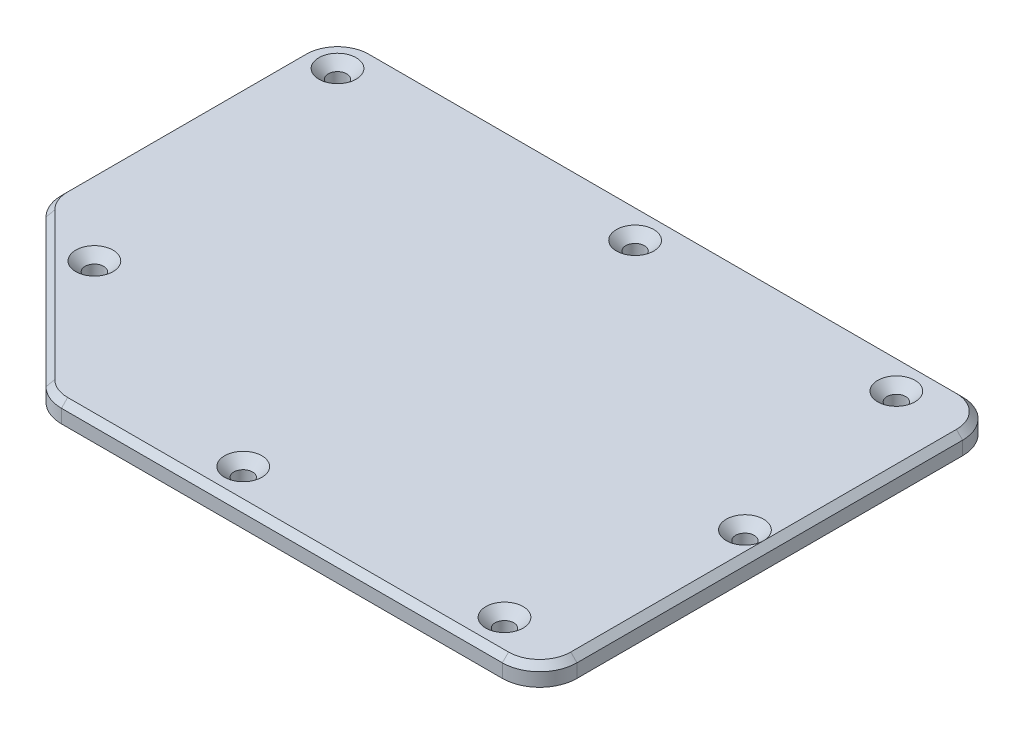
ISO-10303-21;
HEADER;
FILE_DESCRIPTION(('STEP AP214'),'2;1');
FILE_NAME('part.step','',(''),(''),'','','');
FILE_SCHEMA(('AUTOMOTIVE_DESIGN { 1 0 10303 214 1 1 1 1 }'));
ENDSEC;
DATA;
#1=APPLICATION_CONTEXT('core data for automotive mechanical design processes');
#2=APPLICATION_PROTOCOL_DEFINITION('international standard','automotive_design',2000,#1);
#3=PRODUCT_CONTEXT('',#1,'mechanical');
#4=PRODUCT('Part','Part','',(#3));
#5=PRODUCT_RELATED_PRODUCT_CATEGORY('part','',(#4));
#6=PRODUCT_DEFINITION_FORMATION('','',#4);
#7=PRODUCT_DEFINITION_CONTEXT('part definition',#1,'design');
#8=PRODUCT_DEFINITION('design','',#6,#7);
#9=PRODUCT_DEFINITION_SHAPE('','',#8);
#10=(LENGTH_UNIT() NAMED_UNIT(*) SI_UNIT(.MILLI.,.METRE.));
#11=(NAMED_UNIT(*) PLANE_ANGLE_UNIT() SI_UNIT($,.RADIAN.));
#12=(NAMED_UNIT(*) SI_UNIT($,.STERADIAN.) SOLID_ANGLE_UNIT());
#13=UNCERTAINTY_MEASURE_WITH_UNIT(LENGTH_MEASURE(1.E-05),#10,'distance_accuracy_value','');
#14=(GEOMETRIC_REPRESENTATION_CONTEXT(3) GLOBAL_UNCERTAINTY_ASSIGNED_CONTEXT((#13)) GLOBAL_UNIT_ASSIGNED_CONTEXT((#10,
#11,#12)) REPRESENTATION_CONTEXT('',''));
#15=CARTESIAN_POINT('',(0.,0.,0.));
#16=DIRECTION('',(0.,0.,1.));
#17=DIRECTION('',(1.,0.,0.));
#18=AXIS2_PLACEMENT_3D('',#15,#16,#17);
#19=CARTESIAN_POINT('',(-98.,3.175,-63.5));
#20=DIRECTION('',(0.,-1.,0.));
#21=DIRECTION('',(0.,0.,-1.));
#22=AXIS2_PLACEMENT_3D('',#19,#20,#21);
#23=CYLINDRICAL_SURFACE('',#22,6.00000000000001);
#24=DIRECTION('',(0.,-1.,0.));
#25=VECTOR('',#24,1.);
#26=CARTESIAN_POINT('',(-104.,3.175,-63.5));
#27=LINE('',#26,#25);
#28=CARTESIAN_POINT('',(-104.,2.17499999999999,-63.5));
#29=VERTEX_POINT('',#28);
#30=CARTESIAN_POINT('',(-104.,0.,-63.5));
#31=VERTEX_POINT('',#30);
#32=EDGE_CURVE('E143',#29,#31,#27,.T.);
#33=ORIENTED_EDGE('',*,*,#32,.F.);
#34=CARTESIAN_POINT('',(-98.,2.17499999999999,-63.5));
#35=DIRECTION('',(0.,1.,0.));
#36=DIRECTION('',(0.,0.,1.));
#37=AXIS2_PLACEMENT_3D('',#34,#35,#36);
#38=CIRCLE('',#37,6.00000000000001);
#39=CARTESIAN_POINT('',(-98.,2.17499999999999,-69.5));
#40=VERTEX_POINT('',#39);
#41=EDGE_CURVE('E249',#29,#40,#38,.F.);
#42=ORIENTED_EDGE('',*,*,#41,.T.);
#43=DIRECTION('',(0.,-1.,0.));
#44=VECTOR('',#43,1.);
#45=CARTESIAN_POINT('',(-98.,3.175,-69.5));
#46=LINE('',#45,#44);
#47=CARTESIAN_POINT('',(-98.,0.,-69.5));
#48=VERTEX_POINT('',#47);
#49=EDGE_CURVE('E166',#40,#48,#46,.T.);
#50=ORIENTED_EDGE('',*,*,#49,.T.);
#51=CARTESIAN_POINT('',(-98.,0.,-63.5));
#52=DIRECTION('',(0.,1.,0.));
#53=DIRECTION('',(0.,0.,1.));
#54=AXIS2_PLACEMENT_3D('',#51,#52,#53);
#55=CIRCLE('',#54,6.00000000000001);
#56=EDGE_CURVE('E160',#48,#31,#55,.T.);
#57=ORIENTED_EDGE('',*,*,#56,.T.);
#58=EDGE_LOOP('',(#33,#42,#50,#57));
#59=FACE_BOUND('',#58,.T.);
#60=ADVANCED_FACE('F33',(#59),#23,.T.);
#61=CARTESIAN_POINT('',(-104.,3.175,-25.1213203435596));
#62=DIRECTION('',(1.,0.,0.));
#63=DIRECTION('',(0.,0.,-1.));
#64=AXIS2_PLACEMENT_3D('',#61,#62,#63);
#65=PLANE('',#64);
#66=DIRECTION('',(0.,-1.,0.));
#67=VECTOR('',#66,1.);
#68=CARTESIAN_POINT('',(-104.,3.175,-25.1213203435596));
#69=LINE('',#68,#67);
#70=CARTESIAN_POINT('',(-104.,2.17499999999999,-25.1213203435596));
#71=VERTEX_POINT('',#70);
#72=CARTESIAN_POINT('',(-104.,0.,-25.1213203435596));
#73=VERTEX_POINT('',#72);
#74=EDGE_CURVE('E154',#71,#73,#69,.T.);
#75=ORIENTED_EDGE('',*,*,#74,.F.);
#76=DIRECTION('',(0.,0.,-1.));
#77=VECTOR('',#76,1.);
#78=CARTESIAN_POINT('',(-104.,2.17499999999999,-63.5));
#79=LINE('',#78,#77);
#80=EDGE_CURVE('E149',#71,#29,#79,.T.);
#81=ORIENTED_EDGE('',*,*,#80,.T.);
#82=ORIENTED_EDGE('',*,*,#32,.T.);
#83=DIRECTION('',(0.,0.,1.));
#84=VECTOR('',#83,1.);
#85=CARTESIAN_POINT('',(-104.,0.,-25.1213203435596));
#86=LINE('',#85,#84);
#87=EDGE_CURVE('E146',#31,#73,#86,.T.);
#88=ORIENTED_EDGE('',*,*,#87,.T.);
#89=EDGE_LOOP('',(#75,#81,#82,#88));
#90=FACE_BOUND('',#89,.T.);
#91=ADVANCED_FACE('F145',(#90),#65,.F.);
#92=CARTESIAN_POINT('',(-98.,3.175,-25.1213203435596));
#93=DIRECTION('',(0.,-1.,0.));
#94=DIRECTION('',(0.,0.,-1.));
#95=AXIS2_PLACEMENT_3D('',#92,#93,#94);
#96=CYLINDRICAL_SURFACE('',#95,6.);
#97=DIRECTION('',(0.,-1.,0.));
#98=VECTOR('',#97,1.);
#99=CARTESIAN_POINT('',(-102.242640687119,3.175,-20.8786796564403));
#100=LINE('',#99,#98);
#101=CARTESIAN_POINT('',(-102.242640687119,2.17499999999999,-20.8786796564403));
#102=VERTEX_POINT('',#101);
#103=CARTESIAN_POINT('',(-102.242640687119,0.,-20.8786796564403));
#104=VERTEX_POINT('',#103);
#105=EDGE_CURVE('E209',#102,#104,#100,.T.);
#106=ORIENTED_EDGE('',*,*,#105,.F.);
#107=CARTESIAN_POINT('',(-98.,2.17499999999999,-25.1213203435596));
#108=DIRECTION('',(0.,1.,0.));
#109=DIRECTION('',(0.,0.,1.));
#110=AXIS2_PLACEMENT_3D('',#107,#108,#109);
#111=CIRCLE('',#110,6.);
#112=EDGE_CURVE('E53',#102,#71,#111,.F.);
#113=ORIENTED_EDGE('',*,*,#112,.T.);
#114=ORIENTED_EDGE('',*,*,#74,.T.);
#115=CARTESIAN_POINT('',(-98.,0.,-25.1213203435596));
#116=DIRECTION('',(0.,1.,0.));
#117=DIRECTION('',(0.,0.,1.));
#118=AXIS2_PLACEMENT_3D('',#115,#116,#117);
#119=CIRCLE('',#118,6.);
#120=EDGE_CURVE('E163',#73,#104,#119,.T.);
#121=ORIENTED_EDGE('',*,*,#120,.T.);
#122=EDGE_LOOP('',(#106,#113,#114,#121));
#123=FACE_BOUND('',#122,.T.);
#124=ADVANCED_FACE('F414',(#123),#96,.T.);
#125=CARTESIAN_POINT('',(-78.6213203435597,3.175,2.74264068711927));
#126=DIRECTION('',(0.707106781186548,0.,-0.707106781186548));
#127=DIRECTION('',(-0.707106781186548,0.,-0.707106781186548));
#128=AXIS2_PLACEMENT_3D('',#125,#126,#127);
#129=PLANE('',#128);
#130=DIRECTION('',(0.,-1.,0.));
#131=VECTOR('',#130,1.);
#132=CARTESIAN_POINT('',(-78.6213203435597,3.175,2.74264068711927));
#133=LINE('',#132,#131);
#134=CARTESIAN_POINT('',(-78.6213203435597,2.17499999999999,2.74264068711927));
#135=VERTEX_POINT('',#134);
#136=CARTESIAN_POINT('',(-78.6213203435597,0.,2.74264068711927));
#137=VERTEX_POINT('',#136);
#138=EDGE_CURVE('E207',#135,#137,#133,.T.);
#139=ORIENTED_EDGE('',*,*,#138,.F.);
#140=DIRECTION('',(-0.707106781186548,0.,-0.707106781186548));
#141=VECTOR('',#140,1.);
#142=CARTESIAN_POINT('',(-102.242640687119,2.17499999999999,-20.8786796564403));
#143=LINE('',#142,#141);
#144=EDGE_CURVE('E247',#135,#102,#143,.T.);
#145=ORIENTED_EDGE('',*,*,#144,.T.);
#146=ORIENTED_EDGE('',*,*,#105,.T.);
#147=DIRECTION('',(0.707106781186548,0.,0.707106781186548));
#148=VECTOR('',#147,1.);
#149=CARTESIAN_POINT('',(-78.6213203435597,0.,2.74264068711927));
#150=LINE('',#149,#148);
#151=EDGE_CURVE('E176',#104,#137,#150,.T.);
#152=ORIENTED_EDGE('',*,*,#151,.T.);
#153=EDGE_LOOP('',(#139,#145,#146,#152));
#154=FACE_BOUND('',#153,.T.);
#155=ADVANCED_FACE('F714',(#154),#129,.F.);
#156=CARTESIAN_POINT('',(-74.3786796564404,3.175,-1.5));
#157=DIRECTION('',(0.,-1.,0.));
#158=DIRECTION('',(0.,0.,-1.));
#159=AXIS2_PLACEMENT_3D('',#156,#157,#158);
#160=CYLINDRICAL_SURFACE('',#159,6.);
#161=DIRECTION('',(0.,-1.,0.));
#162=VECTOR('',#161,1.);
#163=CARTESIAN_POINT('',(-74.3786796564404,3.175,4.5));
#164=LINE('',#163,#162);
#165=CARTESIAN_POINT('',(-74.3786796564404,2.17499999999999,4.5));
#166=VERTEX_POINT('',#165);
#167=CARTESIAN_POINT('',(-74.3786796564404,0.,4.5));
#168=VERTEX_POINT('',#167);
#169=EDGE_CURVE('E205',#166,#168,#164,.T.);
#170=ORIENTED_EDGE('',*,*,#169,.F.);
#171=CARTESIAN_POINT('',(-74.3786796564404,2.17499999999999,-1.5));
#172=DIRECTION('',(0.,1.,0.));
#173=DIRECTION('',(0.,0.,1.));
#174=AXIS2_PLACEMENT_3D('',#171,#172,#173);
#175=CIRCLE('',#174,6.);
#176=EDGE_CURVE('E243',#166,#135,#175,.F.);
#177=ORIENTED_EDGE('',*,*,#176,.T.);
#178=ORIENTED_EDGE('',*,*,#138,.T.);
#179=CARTESIAN_POINT('',(-74.3786796564404,0.,-1.5));
#180=DIRECTION('',(0.,1.,0.));
#181=DIRECTION('',(0.,0.,1.));
#182=AXIS2_PLACEMENT_3D('',#179,#180,#181);
#183=CIRCLE('',#182,6.);
#184=EDGE_CURVE('E179',#137,#168,#183,.T.);
#185=ORIENTED_EDGE('',*,*,#184,.T.);
#186=EDGE_LOOP('',(#170,#177,#178,#185));
#187=FACE_BOUND('',#186,.T.);
#188=ADVANCED_FACE('F706',(#187),#160,.T.);
#189=CARTESIAN_POINT('',(-74.3786796564404,3.175,4.5));
#190=DIRECTION('',(0.,0.,-1.));
#191=DIRECTION('',(-1.,0.,0.));
#192=AXIS2_PLACEMENT_3D('',#189,#190,#191);
#193=PLANE('',#192);
#194=DIRECTION('',(0.,-1.,0.));
#195=VECTOR('',#194,1.);
#196=CARTESIAN_POINT('',(-3.50000000000002,3.175,4.5));
#197=LINE('',#196,#195);
#198=CARTESIAN_POINT('',(-3.50000000000002,2.17499999999999,4.5));
#199=VERTEX_POINT('',#198);
#200=CARTESIAN_POINT('',(-3.50000000000002,0.,4.5));
#201=VERTEX_POINT('',#200);
#202=EDGE_CURVE('E203',#199,#201,#197,.T.);
#203=ORIENTED_EDGE('',*,*,#202,.F.);
#204=DIRECTION('',(-1.,0.,0.));
#205=VECTOR('',#204,1.);
#206=CARTESIAN_POINT('',(-74.3786796564404,2.17499999999999,4.5));
#207=LINE('',#206,#205);
#208=EDGE_CURVE('E239',#199,#166,#207,.T.);
#209=ORIENTED_EDGE('',*,*,#208,.T.);
#210=ORIENTED_EDGE('',*,*,#169,.T.);
#211=DIRECTION('',(1.,0.,0.));
#212=VECTOR('',#211,1.);
#213=CARTESIAN_POINT('',(-74.3786796564404,0.,4.5));
#214=LINE('',#213,#212);
#215=EDGE_CURVE('E182',#168,#201,#214,.T.);
#216=ORIENTED_EDGE('',*,*,#215,.T.);
#217=EDGE_LOOP('',(#203,#209,#210,#216));
#218=FACE_BOUND('',#217,.T.);
#219=ADVANCED_FACE('F388',(#218),#193,.F.);
#220=CARTESIAN_POINT('',(-3.50000000000002,3.175,-1.5));
#221=DIRECTION('',(0.,-1.,0.));
#222=DIRECTION('',(0.,0.,-1.));
#223=AXIS2_PLACEMENT_3D('',#220,#221,#222);
#224=CYLINDRICAL_SURFACE('',#223,6.);
#225=DIRECTION('',(0.,-1.,0.));
#226=VECTOR('',#225,1.);
#227=CARTESIAN_POINT('',(2.49999999999998,3.175,-1.5));
#228=LINE('',#227,#226);
#229=CARTESIAN_POINT('',(2.49999999999998,2.17499999999999,-1.5));
#230=VERTEX_POINT('',#229);
#231=CARTESIAN_POINT('',(2.49999999999998,0.,-1.5));
#232=VERTEX_POINT('',#231);
#233=EDGE_CURVE('E201',#230,#232,#228,.T.);
#234=ORIENTED_EDGE('',*,*,#233,.F.);
#235=CARTESIAN_POINT('',(-3.50000000000002,2.17499999999999,-1.5));
#236=DIRECTION('',(0.,1.,0.));
#237=DIRECTION('',(0.,0.,1.));
#238=AXIS2_PLACEMENT_3D('',#235,#236,#237);
#239=CIRCLE('',#238,6.);
#240=EDGE_CURVE('E234',#230,#199,#239,.F.);
#241=ORIENTED_EDGE('',*,*,#240,.T.);
#242=ORIENTED_EDGE('',*,*,#202,.T.);
#243=CARTESIAN_POINT('',(-3.50000000000002,0.,-1.5));
#244=DIRECTION('',(0.,1.,0.));
#245=DIRECTION('',(0.,0.,1.));
#246=AXIS2_PLACEMENT_3D('',#243,#244,#245);
#247=CIRCLE('',#246,6.);
#248=EDGE_CURVE('E185',#201,#232,#247,.T.);
#249=ORIENTED_EDGE('',*,*,#248,.T.);
#250=EDGE_LOOP('',(#234,#241,#242,#249));
#251=FACE_BOUND('',#250,.T.);
#252=ADVANCED_FACE('F386',(#251),#224,.T.);
#253=CARTESIAN_POINT('',(2.49999999999998,3.175,-1.5));
#254=DIRECTION('',(-1.,0.,0.));
#255=DIRECTION('',(0.,0.,1.));
#256=AXIS2_PLACEMENT_3D('',#253,#254,#255);
#257=PLANE('',#256);
#258=DIRECTION('',(0.,-1.,0.));
#259=VECTOR('',#258,1.);
#260=CARTESIAN_POINT('',(2.5,3.175,-63.5));
#261=LINE('',#260,#259);
#262=CARTESIAN_POINT('',(2.5,2.17499999999999,-63.5));
#263=VERTEX_POINT('',#262);
#264=CARTESIAN_POINT('',(2.5,0.,-63.5));
#265=VERTEX_POINT('',#264);
#266=EDGE_CURVE('E199',#263,#265,#261,.T.);
#267=ORIENTED_EDGE('',*,*,#266,.F.);
#268=DIRECTION('',(0.,0.,1.));
#269=VECTOR('',#268,1.);
#270=CARTESIAN_POINT('',(2.49999999999998,2.17499999999999,-1.5));
#271=LINE('',#270,#269);
#272=EDGE_CURVE('E237',#263,#230,#271,.T.);
#273=ORIENTED_EDGE('',*,*,#272,.T.);
#274=ORIENTED_EDGE('',*,*,#233,.T.);
#275=DIRECTION('',(0.,0.,-1.));
#276=VECTOR('',#275,1.);
#277=CARTESIAN_POINT('',(2.49999999999998,0.,-1.5));
#278=LINE('',#277,#276);
#279=EDGE_CURVE('E188',#232,#265,#278,.T.);
#280=ORIENTED_EDGE('',*,*,#279,.T.);
#281=EDGE_LOOP('',(#267,#273,#274,#280));
#282=FACE_BOUND('',#281,.T.);
#283=ADVANCED_FACE('F397',(#282),#257,.F.);
#284=CARTESIAN_POINT('',(-3.50000000000002,3.175,-63.5));
#285=DIRECTION('',(0.,-1.,0.));
#286=DIRECTION('',(0.,0.,-1.));
#287=AXIS2_PLACEMENT_3D('',#284,#285,#286);
#288=CYLINDRICAL_SURFACE('',#287,6.00000000000002);
#289=DIRECTION('',(0.,-1.,0.));
#290=VECTOR('',#289,1.);
#291=CARTESIAN_POINT('',(-3.50000000000002,3.175,-69.5));
#292=LINE('',#291,#290);
#293=CARTESIAN_POINT('',(-3.50000000000002,2.17499999999999,-69.5));
#294=VERTEX_POINT('',#293);
#295=CARTESIAN_POINT('',(-3.50000000000002,0.,-69.5));
#296=VERTEX_POINT('',#295);
#297=EDGE_CURVE('E197',#294,#296,#292,.T.);
#298=ORIENTED_EDGE('',*,*,#297,.F.);
#299=CARTESIAN_POINT('',(-3.50000000000002,2.17499999999999,-63.5));
#300=DIRECTION('',(0.,1.,0.));
#301=DIRECTION('',(0.,0.,1.));
#302=AXIS2_PLACEMENT_3D('',#299,#300,#301);
#303=CIRCLE('',#302,6.00000000000002);
#304=EDGE_CURVE('E241',#294,#263,#303,.F.);
#305=ORIENTED_EDGE('',*,*,#304,.T.);
#306=ORIENTED_EDGE('',*,*,#266,.T.);
#307=CARTESIAN_POINT('',(-3.50000000000002,0.,-63.5));
#308=DIRECTION('',(0.,1.,0.));
#309=DIRECTION('',(0.,0.,1.));
#310=AXIS2_PLACEMENT_3D('',#307,#308,#309);
#311=CIRCLE('',#310,6.00000000000002);
#312=EDGE_CURVE('E191',#265,#296,#311,.T.);
#313=ORIENTED_EDGE('',*,*,#312,.T.);
#314=EDGE_LOOP('',(#298,#305,#306,#313));
#315=FACE_BOUND('',#314,.T.);
#316=ADVANCED_FACE('F400',(#315),#288,.T.);
#317=CARTESIAN_POINT('',(-3.50000000000002,3.175,-69.5));
#318=DIRECTION('',(0.,0.,1.));
#319=DIRECTION('',(1.,0.,0.));
#320=AXIS2_PLACEMENT_3D('',#317,#318,#319);
#321=PLANE('',#320);
#322=ORIENTED_EDGE('',*,*,#49,.F.);
#323=DIRECTION('',(1.,0.,0.));
#324=VECTOR('',#323,1.);
#325=CARTESIAN_POINT('',(-3.50000000000002,2.17499999999999,-69.5));
#326=LINE('',#325,#324);
#327=EDGE_CURVE('E245',#40,#294,#326,.T.);
#328=ORIENTED_EDGE('',*,*,#327,.T.);
#329=ORIENTED_EDGE('',*,*,#297,.T.);
#330=DIRECTION('',(-1.,0.,0.));
#331=VECTOR('',#330,1.);
#332=CARTESIAN_POINT('',(-3.50000000000002,0.,-69.5));
#333=LINE('',#332,#331);
#334=EDGE_CURVE('E194',#296,#48,#333,.T.);
#335=ORIENTED_EDGE('',*,*,#334,.T.);
#336=EDGE_LOOP('',(#322,#328,#329,#335));
#337=FACE_BOUND('',#336,.T.);
#338=ADVANCED_FACE('F330',(#337),#321,.F.);
#339=CARTESIAN_POINT('',(-98.,3.175,-63.5));
#340=DIRECTION('',(0.,1.,0.));
#341=DIRECTION('',(0.,0.,1.));
#342=AXIS2_PLACEMENT_3D('',#339,#340,#341);
#343=PLANE('',#342);
#344=CARTESIAN_POINT('',(-91.2520483659706,3.175,-17.6662619283437));
#345=DIRECTION('',(0.,1.,0.));
#346=DIRECTION('',(0.,0.,1.));
#347=AXIS2_PLACEMENT_3D('',#344,#345,#346);
#348=CIRCLE('',#347,2.99999999999999);
#349=CARTESIAN_POINT('',(-91.2520483659706,3.175,-14.6662619283438));
#350=VERTEX_POINT('',#349);
#351=EDGE_CURVE('E297',#350,#350,#348,.F.);
#352=ORIENTED_EDGE('',*,*,#351,.T.);
#353=EDGE_LOOP('',(#352));
#354=FACE_BOUND('',#353,.T.);
#355=CARTESIAN_POINT('',(-50.6568542494924,3.175,-1.00000000000001));
#356=DIRECTION('',(0.,1.,0.));
#357=DIRECTION('',(0.,0.,1.));
#358=AXIS2_PLACEMENT_3D('',#355,#356,#357);
#359=CIRCLE('',#358,2.99999999999999);
#360=CARTESIAN_POINT('',(-50.6568542494924,3.175,1.99999999999998));
#361=VERTEX_POINT('',#360);
#362=EDGE_CURVE('E294',#361,#361,#359,.F.);
#363=ORIENTED_EDGE('',*,*,#362,.T.);
#364=EDGE_LOOP('',(#363));
#365=FACE_BOUND('',#364,.T.);
#366=CARTESIAN_POINT('',(-8.65685424949237,3.175,-1.));
#367=DIRECTION('',(0.,1.,0.));
#368=DIRECTION('',(0.,0.,1.));
#369=AXIS2_PLACEMENT_3D('',#366,#367,#368);
#370=CIRCLE('',#369,2.99999999999999);
#371=CARTESIAN_POINT('',(-8.65685424949237,3.175,1.99999999999998));
#372=VERTEX_POINT('',#371);
#373=EDGE_CURVE('E291',#372,#372,#370,.F.);
#374=ORIENTED_EDGE('',*,*,#373,.T.);
#375=EDGE_LOOP('',(#374));
#376=FACE_BOUND('',#375,.T.);
#377=CARTESIAN_POINT('',(-8.65685424949237,3.175,-64.));
#378=DIRECTION('',(0.,1.,0.));
#379=DIRECTION('',(0.,0.,1.));
#380=AXIS2_PLACEMENT_3D('',#377,#378,#379);
#381=CIRCLE('',#380,2.99999999999999);
#382=CARTESIAN_POINT('',(-8.65685424949237,3.175,-61.));
#383=VERTEX_POINT('',#382);
#384=EDGE_CURVE('E288',#383,#383,#381,.F.);
#385=ORIENTED_EDGE('',*,*,#384,.T.);
#386=EDGE_LOOP('',(#385));
#387=FACE_BOUND('',#386,.T.);
#388=CARTESIAN_POINT('',(-50.6568542494924,3.175,-64.));
#389=DIRECTION('',(0.,1.,0.));
#390=DIRECTION('',(0.,0.,1.));
#391=AXIS2_PLACEMENT_3D('',#388,#389,#390);
#392=CIRCLE('',#391,2.99999999999999);
#393=CARTESIAN_POINT('',(-50.6568542494924,3.175,-61.));
#394=VERTEX_POINT('',#393);
#395=EDGE_CURVE('E285',#394,#394,#392,.F.);
#396=ORIENTED_EDGE('',*,*,#395,.T.);
#397=EDGE_LOOP('',(#396));
#398=FACE_BOUND('',#397,.T.);
#399=CARTESIAN_POINT('',(-98.5,3.175,-64.));
#400=DIRECTION('',(0.,1.,0.));
#401=DIRECTION('',(0.,0.,1.));
#402=AXIS2_PLACEMENT_3D('',#399,#400,#401);
#403=CIRCLE('',#402,2.99999999999999);
#404=CARTESIAN_POINT('',(-98.5,3.175,-61.));
#405=VERTEX_POINT('',#404);
#406=EDGE_CURVE('E253',#405,#405,#403,.F.);
#407=ORIENTED_EDGE('',*,*,#406,.T.);
#408=EDGE_LOOP('',(#407));
#409=FACE_BOUND('',#408,.T.);
#410=DIRECTION('',(0.,0.,-1.));
#411=VECTOR('',#410,1.);
#412=CARTESIAN_POINT('',(1.49999999999997,3.175,-63.5));
#413=LINE('',#412,#411);
#414=CARTESIAN_POINT('',(1.49999999999996,3.175,-1.5));
#415=VERTEX_POINT('',#414);
#416=CARTESIAN_POINT('',(1.49999999999997,3.175,-32.5));
#417=VERTEX_POINT('',#416);
#418=EDGE_CURVE('E228',#415,#417,#413,.T.);
#419=ORIENTED_EDGE('',*,*,#418,.T.);
#420=CARTESIAN_POINT('',(-1.5,3.175,-32.5));
#421=DIRECTION('',(0.,1.,0.));
#422=DIRECTION('',(0.,0.,1.));
#423=AXIS2_PLACEMENT_3D('',#420,#421,#422);
#424=CIRCLE('',#423,2.99999999999999);
#425=EDGE_CURVE('E46',#417,#417,#424,.F.);
#426=ORIENTED_EDGE('',*,*,#425,.T.);
#427=CARTESIAN_POINT('',(1.49999999999997,3.175,-63.5));
#428=VERTEX_POINT('',#427);
#429=EDGE_CURVE('E227',#417,#428,#413,.T.);
#430=ORIENTED_EDGE('',*,*,#429,.T.);
#431=CARTESIAN_POINT('',(-3.50000000000002,3.175,-63.5));
#432=DIRECTION('',(0.,1.,0.));
#433=DIRECTION('',(0.,0.,1.));
#434=AXIS2_PLACEMENT_3D('',#431,#432,#433);
#435=CIRCLE('',#434,4.99999999999999);
#436=CARTESIAN_POINT('',(-3.50000000000002,3.175,-68.5));
#437=VERTEX_POINT('',#436);
#438=EDGE_CURVE('E223',#428,#437,#435,.T.);
#439=ORIENTED_EDGE('',*,*,#438,.T.);
#440=DIRECTION('',(-1.,0.,0.));
#441=VECTOR('',#440,1.);
#442=CARTESIAN_POINT('',(-98.,3.175,-68.5));
#443=LINE('',#442,#441);
#444=CARTESIAN_POINT('',(-98.,3.175,-68.5));
#445=VERTEX_POINT('',#444);
#446=EDGE_CURVE('E219',#437,#445,#443,.T.);
#447=ORIENTED_EDGE('',*,*,#446,.T.);
#448=CARTESIAN_POINT('',(-98.,3.175,-63.5));
#449=DIRECTION('',(0.,1.,0.));
#450=DIRECTION('',(0.,0.,1.));
#451=AXIS2_PLACEMENT_3D('',#448,#449,#450);
#452=CIRCLE('',#451,4.99999999999998);
#453=CARTESIAN_POINT('',(-103.,3.175,-63.5));
#454=VERTEX_POINT('',#453);
#455=EDGE_CURVE('E215',#445,#454,#452,.T.);
#456=ORIENTED_EDGE('',*,*,#455,.T.);
#457=DIRECTION('',(0.,0.,1.));
#458=VECTOR('',#457,1.);
#459=CARTESIAN_POINT('',(-103.,3.175,-25.1213203435596));
#460=LINE('',#459,#458);
#461=CARTESIAN_POINT('',(-103.,3.175,-25.1213203435596));
#462=VERTEX_POINT('',#461);
#463=EDGE_CURVE('E153',#454,#462,#460,.T.);
#464=ORIENTED_EDGE('',*,*,#463,.T.);
#465=CARTESIAN_POINT('',(-98.,3.175,-25.1213203435596));
#466=DIRECTION('',(0.,1.,0.));
#467=DIRECTION('',(0.,0.,1.));
#468=AXIS2_PLACEMENT_3D('',#465,#466,#467);
#469=CIRCLE('',#468,4.99999999999997);
#470=CARTESIAN_POINT('',(-101.535533905933,3.175,-21.5857864376269));
#471=VERTEX_POINT('',#470);
#472=EDGE_CURVE('E213',#462,#471,#469,.T.);
#473=ORIENTED_EDGE('',*,*,#472,.T.);
#474=DIRECTION('',(0.707106781186548,0.,0.707106781186548));
#475=VECTOR('',#474,1.);
#476=CARTESIAN_POINT('',(-77.9142135623731,3.175,2.03553390593269));
#477=LINE('',#476,#475);
#478=CARTESIAN_POINT('',(-77.9142135623731,3.175,2.03553390593269));
#479=VERTEX_POINT('',#478);
#480=EDGE_CURVE('E217',#471,#479,#477,.T.);
#481=ORIENTED_EDGE('',*,*,#480,.T.);
#482=CARTESIAN_POINT('',(-74.3786796564404,3.175,-1.5));
#483=DIRECTION('',(0.,1.,0.));
#484=DIRECTION('',(0.,0.,1.));
#485=AXIS2_PLACEMENT_3D('',#482,#483,#484);
#486=CIRCLE('',#485,4.99999999999997);
#487=CARTESIAN_POINT('',(-74.3786796564404,3.175,3.49999999999997));
#488=VERTEX_POINT('',#487);
#489=EDGE_CURVE('E221',#479,#488,#486,.T.);
#490=ORIENTED_EDGE('',*,*,#489,.T.);
#491=DIRECTION('',(1.,0.,0.));
#492=VECTOR('',#491,1.);
#493=CARTESIAN_POINT('',(-3.50000000000002,3.175,3.49999999999997));
#494=LINE('',#493,#492);
#495=CARTESIAN_POINT('',(-3.50000000000002,3.175,3.49999999999997));
#496=VERTEX_POINT('',#495);
#497=EDGE_CURVE('E225',#488,#496,#494,.T.);
#498=ORIENTED_EDGE('',*,*,#497,.T.);
#499=CARTESIAN_POINT('',(-3.50000000000002,3.175,-1.5));
#500=DIRECTION('',(0.,1.,0.));
#501=DIRECTION('',(0.,0.,1.));
#502=AXIS2_PLACEMENT_3D('',#499,#500,#501);
#503=CIRCLE('',#502,4.99999999999998);
#504=EDGE_CURVE('E231',#496,#415,#503,.T.);
#505=ORIENTED_EDGE('',*,*,#504,.T.);
#506=EDGE_LOOP('',(#419,#426,#430,#439,#447,#456,#464,#473,#481,#490,#498,#505));
#507=FACE_BOUND('',#506,.T.);
#508=ADVANCED_FACE('F327',(#354,#365,#376,#387,#398,#409,#507),#343,.T.);
#509=CARTESIAN_POINT('',(-98.,0.,-63.5));
#510=DIRECTION('',(0.,1.,0.));
#511=DIRECTION('',(0.,0.,1.));
#512=AXIS2_PLACEMENT_3D('',#509,#510,#511);
#513=PLANE('',#512);
#514=CARTESIAN_POINT('',(-1.5,0.,-32.5));
#515=DIRECTION('',(0.,-1.,0.));
#516=DIRECTION('',(0.,0.,-1.));
#517=AXIS2_PLACEMENT_3D('',#514,#515,#516);
#518=CIRCLE('',#517,1.5);
#519=CARTESIAN_POINT('',(-1.5,0.,-34.));
#520=VERTEX_POINT('',#519);
#521=EDGE_CURVE('E282',#520,#520,#518,.T.);
#522=ORIENTED_EDGE('',*,*,#521,.F.);
#523=EDGE_LOOP('',(#522));
#524=FACE_BOUND('',#523,.T.);
#525=CARTESIAN_POINT('',(-8.65685424949237,0.,-1.));
#526=DIRECTION('',(0.,-1.,0.));
#527=DIRECTION('',(0.,0.,-1.));
#528=AXIS2_PLACEMENT_3D('',#525,#526,#527);
#529=CIRCLE('',#528,1.5);
#530=CARTESIAN_POINT('',(-8.65685424949237,0.,-2.5));
#531=VERTEX_POINT('',#530);
#532=EDGE_CURVE('E502',#531,#531,#529,.T.);
#533=ORIENTED_EDGE('',*,*,#532,.F.);
#534=EDGE_LOOP('',(#533));
#535=FACE_BOUND('',#534,.T.);
#536=CARTESIAN_POINT('',(-50.6568542494924,0.,-1.00000000000001));
#537=DIRECTION('',(0.,-1.,0.));
#538=DIRECTION('',(0.,0.,-1.));
#539=AXIS2_PLACEMENT_3D('',#536,#537,#538);
#540=CIRCLE('',#539,1.5);
#541=CARTESIAN_POINT('',(-50.6568542494924,0.,-2.50000000000001));
#542=VERTEX_POINT('',#541);
#543=EDGE_CURVE('E505',#542,#542,#540,.T.);
#544=ORIENTED_EDGE('',*,*,#543,.F.);
#545=EDGE_LOOP('',(#544));
#546=FACE_BOUND('',#545,.T.);
#547=CARTESIAN_POINT('',(-91.2520483659706,0.,-17.6662619283437));
#548=DIRECTION('',(0.,-1.,0.));
#549=DIRECTION('',(0.,0.,-1.));
#550=AXIS2_PLACEMENT_3D('',#547,#548,#549);
#551=CIRCLE('',#550,1.5);
#552=CARTESIAN_POINT('',(-91.2520483659706,0.,-19.1662619283437));
#553=VERTEX_POINT('',#552);
#554=EDGE_CURVE('E510',#553,#553,#551,.T.);
#555=ORIENTED_EDGE('',*,*,#554,.F.);
#556=EDGE_LOOP('',(#555));
#557=FACE_BOUND('',#556,.T.);
#558=CARTESIAN_POINT('',(-98.5,0.,-64.));
#559=DIRECTION('',(0.,-1.,0.));
#560=DIRECTION('',(0.,0.,-1.));
#561=AXIS2_PLACEMENT_3D('',#558,#559,#560);
#562=CIRCLE('',#561,1.5);
#563=CARTESIAN_POINT('',(-98.5,0.,-65.5));
#564=VERTEX_POINT('',#563);
#565=EDGE_CURVE('E513',#564,#564,#562,.T.);
#566=ORIENTED_EDGE('',*,*,#565,.F.);
#567=EDGE_LOOP('',(#566));
#568=FACE_BOUND('',#567,.T.);
#569=CARTESIAN_POINT('',(-50.6568542494924,0.,-64.));
#570=DIRECTION('',(0.,-1.,0.));
#571=DIRECTION('',(0.,0.,-1.));
#572=AXIS2_PLACEMENT_3D('',#569,#570,#571);
#573=CIRCLE('',#572,1.5);
#574=CARTESIAN_POINT('',(-50.6568542494924,0.,-65.5));
#575=VERTEX_POINT('',#574);
#576=EDGE_CURVE('E171',#575,#575,#573,.T.);
#577=ORIENTED_EDGE('',*,*,#576,.F.);
#578=EDGE_LOOP('',(#577));
#579=FACE_BOUND('',#578,.T.);
#580=CARTESIAN_POINT('',(-8.65685424949237,0.,-64.));
#581=DIRECTION('',(0.,-1.,0.));
#582=DIRECTION('',(0.,0.,-1.));
#583=AXIS2_PLACEMENT_3D('',#580,#581,#582);
#584=CIRCLE('',#583,1.5);
#585=CARTESIAN_POINT('',(-8.65685424949237,0.,-65.5));
#586=VERTEX_POINT('',#585);
#587=EDGE_CURVE('E168',#586,#586,#584,.T.);
#588=ORIENTED_EDGE('',*,*,#587,.F.);
#589=EDGE_LOOP('',(#588));
#590=FACE_BOUND('',#589,.T.);
#591=ORIENTED_EDGE('',*,*,#56,.F.);
#592=ORIENTED_EDGE('',*,*,#334,.F.);
#593=ORIENTED_EDGE('',*,*,#312,.F.);
#594=ORIENTED_EDGE('',*,*,#279,.F.);
#595=ORIENTED_EDGE('',*,*,#248,.F.);
#596=ORIENTED_EDGE('',*,*,#215,.F.);
#597=ORIENTED_EDGE('',*,*,#184,.F.);
#598=ORIENTED_EDGE('',*,*,#151,.F.);
#599=ORIENTED_EDGE('',*,*,#120,.F.);
#600=ORIENTED_EDGE('',*,*,#87,.F.);
#601=EDGE_LOOP('',(#591,#592,#593,#594,#595,#596,#597,#598,#599,#600));
#602=FACE_BOUND('',#601,.T.);
#603=ADVANCED_FACE('F158',(#524,#535,#546,#557,#568,#579,#590,#602),#513,.F.);
#604=CARTESIAN_POINT('',(-8.65685424949237,3.175,-64.));
#605=DIRECTION('',(0.,-1.,0.));
#606=DIRECTION('',(0.,0.,-1.));
#607=AXIS2_PLACEMENT_3D('',#604,#605,#606);
#608=CYLINDRICAL_SURFACE('',#607,1.5);
#609=CARTESIAN_POINT('',(-8.65685424949237,1.67500000000001,-64.));
#610=DIRECTION('',(0.,1.,0.));
#611=DIRECTION('',(0.,0.,1.));
#612=AXIS2_PLACEMENT_3D('',#609,#610,#611);
#613=CIRCLE('',#612,1.5);
#614=CARTESIAN_POINT('',(-8.65685424949237,1.67500000000001,-62.5));
#615=VERTEX_POINT('',#614);
#616=EDGE_CURVE('E313',#615,#615,#613,.T.);
#617=ORIENTED_EDGE('',*,*,#616,.T.);
#618=EDGE_LOOP('',(#617));
#619=FACE_BOUND('',#618,.T.);
#620=ORIENTED_EDGE('',*,*,#587,.T.);
#621=EDGE_LOOP('',(#620));
#622=FACE_BOUND('',#621,.T.);
#623=ADVANCED_FACE('F464',(#619,#622),#608,.F.);
#624=CARTESIAN_POINT('',(-50.6568542494924,3.175,-64.));
#625=DIRECTION('',(0.,-1.,0.));
#626=DIRECTION('',(0.,0.,-1.));
#627=AXIS2_PLACEMENT_3D('',#624,#625,#626);
#628=CYLINDRICAL_SURFACE('',#627,1.5);
#629=CARTESIAN_POINT('',(-50.6568542494924,1.67500000000001,-64.));
#630=DIRECTION('',(0.,1.,0.));
#631=DIRECTION('',(0.,0.,1.));
#632=AXIS2_PLACEMENT_3D('',#629,#630,#631);
#633=CIRCLE('',#632,1.5);
#634=CARTESIAN_POINT('',(-50.6568542494924,1.67500000000001,-62.5));
#635=VERTEX_POINT('',#634);
#636=EDGE_CURVE('E41',#635,#635,#633,.T.);
#637=ORIENTED_EDGE('',*,*,#636,.T.);
#638=EDGE_LOOP('',(#637));
#639=FACE_BOUND('',#638,.T.);
#640=ORIENTED_EDGE('',*,*,#576,.T.);
#641=EDGE_LOOP('',(#640));
#642=FACE_BOUND('',#641,.T.);
#643=ADVANCED_FACE('F318',(#639,#642),#628,.F.);
#644=CARTESIAN_POINT('',(-98.5,3.175,-64.));
#645=DIRECTION('',(0.,-1.,0.));
#646=DIRECTION('',(0.,0.,-1.));
#647=AXIS2_PLACEMENT_3D('',#644,#645,#646);
#648=CYLINDRICAL_SURFACE('',#647,1.5);
#649=CARTESIAN_POINT('',(-98.5,1.67499999999998,-64.));
#650=DIRECTION('',(0.,1.,0.));
#651=DIRECTION('',(0.,0.,1.));
#652=AXIS2_PLACEMENT_3D('',#649,#650,#651);
#653=CIRCLE('',#652,1.5);
#654=CARTESIAN_POINT('',(-98.5,1.67499999999998,-62.5));
#655=VERTEX_POINT('',#654);
#656=EDGE_CURVE('E11',#655,#655,#653,.T.);
#657=ORIENTED_EDGE('',*,*,#656,.T.);
#658=EDGE_LOOP('',(#657));
#659=FACE_BOUND('',#658,.T.);
#660=ORIENTED_EDGE('',*,*,#565,.T.);
#661=EDGE_LOOP('',(#660));
#662=FACE_BOUND('',#661,.T.);
#663=ADVANCED_FACE('F479',(#659,#662),#648,.F.);
#664=CARTESIAN_POINT('',(-91.2520483659706,3.175,-17.6662619283437));
#665=DIRECTION('',(0.,-1.,0.));
#666=DIRECTION('',(0.,0.,-1.));
#667=AXIS2_PLACEMENT_3D('',#664,#665,#666);
#668=CYLINDRICAL_SURFACE('',#667,1.5);
#669=CARTESIAN_POINT('',(-91.2520483659706,1.67499999999998,-17.6662619283437));
#670=DIRECTION('',(0.,1.,0.));
#671=DIRECTION('',(0.,0.,1.));
#672=AXIS2_PLACEMENT_3D('',#669,#670,#671);
#673=CIRCLE('',#672,1.5);
#674=CARTESIAN_POINT('',(-91.2520483659706,1.67499999999998,-16.1662619283437));
#675=VERTEX_POINT('',#674);
#676=EDGE_CURVE('E304',#675,#675,#673,.T.);
#677=ORIENTED_EDGE('',*,*,#676,.T.);
#678=EDGE_LOOP('',(#677));
#679=FACE_BOUND('',#678,.T.);
#680=ORIENTED_EDGE('',*,*,#554,.T.);
#681=EDGE_LOOP('',(#680));
#682=FACE_BOUND('',#681,.T.);
#683=ADVANCED_FACE('F482',(#679,#682),#668,.F.);
#684=CARTESIAN_POINT('',(-50.6568542494924,3.175,-1.00000000000001));
#685=DIRECTION('',(0.,-1.,0.));
#686=DIRECTION('',(0.,0.,-1.));
#687=AXIS2_PLACEMENT_3D('',#684,#685,#686);
#688=CYLINDRICAL_SURFACE('',#687,1.5);
#689=CARTESIAN_POINT('',(-50.6568542494924,1.67500000000002,-1.00000000000001));
#690=DIRECTION('',(0.,1.,0.));
#691=DIRECTION('',(0.,0.,1.));
#692=AXIS2_PLACEMENT_3D('',#689,#690,#691);
#693=CIRCLE('',#692,1.5);
#694=CARTESIAN_POINT('',(-50.6568542494924,1.67500000000002,0.499999999999999));
#695=VERTEX_POINT('',#694);
#696=EDGE_CURVE('E307',#695,#695,#693,.T.);
#697=ORIENTED_EDGE('',*,*,#696,.T.);
#698=EDGE_LOOP('',(#697));
#699=FACE_BOUND('',#698,.T.);
#700=ORIENTED_EDGE('',*,*,#543,.T.);
#701=EDGE_LOOP('',(#700));
#702=FACE_BOUND('',#701,.T.);
#703=ADVANCED_FACE('F486',(#699,#702),#688,.F.);
#704=CARTESIAN_POINT('',(-8.65685424949237,3.175,-1.));
#705=DIRECTION('',(0.,-1.,0.));
#706=DIRECTION('',(0.,0.,-1.));
#707=AXIS2_PLACEMENT_3D('',#704,#705,#706);
#708=CYLINDRICAL_SURFACE('',#707,1.5);
#709=CARTESIAN_POINT('',(-8.65685424949237,1.67500000000002,-1.));
#710=DIRECTION('',(0.,1.,0.));
#711=DIRECTION('',(0.,0.,1.));
#712=AXIS2_PLACEMENT_3D('',#709,#710,#711);
#713=CIRCLE('',#712,1.5);
#714=CARTESIAN_POINT('',(-8.65685424949237,1.67500000000002,0.499999999999996));
#715=VERTEX_POINT('',#714);
#716=EDGE_CURVE('E310',#715,#715,#713,.T.);
#717=ORIENTED_EDGE('',*,*,#716,.T.);
#718=EDGE_LOOP('',(#717));
#719=FACE_BOUND('',#718,.T.);
#720=ORIENTED_EDGE('',*,*,#532,.T.);
#721=EDGE_LOOP('',(#720));
#722=FACE_BOUND('',#721,.T.);
#723=ADVANCED_FACE('F490',(#719,#722),#708,.F.);
#724=CARTESIAN_POINT('',(-1.5,3.175,-32.5));
#725=DIRECTION('',(0.,-1.,0.));
#726=DIRECTION('',(0.,0.,-1.));
#727=AXIS2_PLACEMENT_3D('',#724,#725,#726);
#728=CYLINDRICAL_SURFACE('',#727,1.5);
#729=CARTESIAN_POINT('',(-1.5,1.67500000000001,-32.5));
#730=DIRECTION('',(0.,1.,0.));
#731=DIRECTION('',(0.,0.,1.));
#732=AXIS2_PLACEMENT_3D('',#729,#730,#731);
#733=CIRCLE('',#732,1.5);
#734=CARTESIAN_POINT('',(-1.5,1.67500000000001,-31.));
#735=VERTEX_POINT('',#734);
#736=EDGE_CURVE('E301',#735,#735,#733,.T.);
#737=ORIENTED_EDGE('',*,*,#736,.T.);
#738=EDGE_LOOP('',(#737));
#739=FACE_BOUND('',#738,.T.);
#740=ORIENTED_EDGE('',*,*,#521,.T.);
#741=EDGE_LOOP('',(#740));
#742=FACE_BOUND('',#741,.T.);
#743=ADVANCED_FACE('F439',(#739,#742),#728,.F.);
#744=CARTESIAN_POINT('',(-103.,3.175,-63.5));
#745=DIRECTION('',(-0.707106781186543,0.707106781186552,0.));
#746=DIRECTION('',(0.,0.,-1.));
#747=AXIS2_PLACEMENT_3D('',#744,#745,#746);
#748=PLANE('',#747);
#749=DIRECTION('',(0.707106781186552,0.707106781186543,0.));
#750=VECTOR('',#749,1.);
#751=CARTESIAN_POINT('',(-104.,2.17499999999999,-63.5));
#752=LINE('',#751,#750);
#753=EDGE_CURVE('E276',#29,#454,#752,.T.);
#754=ORIENTED_EDGE('',*,*,#753,.F.);
#755=ORIENTED_EDGE('',*,*,#80,.F.);
#756=DIRECTION('',(-0.707106781186552,-0.707106781186543,0.));
#757=VECTOR('',#756,1.);
#758=CARTESIAN_POINT('',(-103.,3.175,-25.1213203435596));
#759=LINE('',#758,#757);
#760=EDGE_CURVE('E279',#462,#71,#759,.T.);
#761=ORIENTED_EDGE('',*,*,#760,.F.);
#762=ORIENTED_EDGE('',*,*,#463,.F.);
#763=EDGE_LOOP('',(#754,#755,#761,#762));
#764=FACE_BOUND('',#763,.T.);
#765=ADVANCED_FACE('F359',(#764),#748,.T.);
#766=CARTESIAN_POINT('',(-98.,3.175,-25.1213203435596));
#767=DIRECTION('',(0.,-1.,0.));
#768=DIRECTION('',(0.,0.,-1.));
#769=AXIS2_PLACEMENT_3D('',#766,#767,#768);
#770=CONICAL_SURFACE('',#769,4.99999999999997,0.785398163397457);
#771=ORIENTED_EDGE('',*,*,#760,.T.);
#772=ORIENTED_EDGE('',*,*,#112,.F.);
#773=DIRECTION('',(-0.500000000000006,-0.707106781186541,0.500000000000003));
#774=VECTOR('',#773,1.);
#775=CARTESIAN_POINT('',(-101.535533905933,3.175,-21.5857864376269));
#776=LINE('',#775,#774);
#777=EDGE_CURVE('E273',#471,#102,#776,.T.);
#778=ORIENTED_EDGE('',*,*,#777,.F.);
#779=ORIENTED_EDGE('',*,*,#472,.F.);
#780=EDGE_LOOP('',(#771,#772,#778,#779));
#781=FACE_BOUND('',#780,.T.);
#782=ADVANCED_FACE('F366',(#781),#770,.T.);
#783=CARTESIAN_POINT('',(-98.,3.175,-63.5));
#784=DIRECTION('',(0.,-1.,0.));
#785=DIRECTION('',(0.,0.,-1.));
#786=AXIS2_PLACEMENT_3D('',#783,#784,#785);
#787=CONICAL_SURFACE('',#786,4.99999999999998,0.785398163397455);
#788=ORIENTED_EDGE('',*,*,#753,.T.);
#789=ORIENTED_EDGE('',*,*,#455,.F.);
#790=DIRECTION('',(0.,0.707106781186543,0.707106781186552));
#791=VECTOR('',#790,1.);
#792=CARTESIAN_POINT('',(-98.,2.17499999999999,-69.5));
#793=LINE('',#792,#791);
#794=EDGE_CURVE('E270',#40,#445,#793,.T.);
#795=ORIENTED_EDGE('',*,*,#794,.F.);
#796=ORIENTED_EDGE('',*,*,#41,.F.);
#797=EDGE_LOOP('',(#788,#789,#795,#796));
#798=FACE_BOUND('',#797,.T.);
#799=ADVANCED_FACE('F356',(#798),#787,.T.);
#800=CARTESIAN_POINT('',(-120.724873734153,3.175,-40.7751262658471));
#801=DIRECTION('',(-0.49999999999999,0.707106781186562,0.49999999999999));
#802=DIRECTION('',(-0.707106781186548,0.,-0.707106781186548));
#803=AXIS2_PLACEMENT_3D('',#800,#801,#802);
#804=PLANE('',#803);
#805=ORIENTED_EDGE('',*,*,#777,.T.);
#806=ORIENTED_EDGE('',*,*,#144,.F.);
#807=DIRECTION('',(-0.500000000000011,-0.707106781186534,0.500000000000008));
#808=VECTOR('',#807,1.);
#809=CARTESIAN_POINT('',(-77.9142135623731,3.175,2.03553390593269));
#810=LINE('',#809,#808);
#811=EDGE_CURVE('E267',#479,#135,#810,.T.);
#812=ORIENTED_EDGE('',*,*,#811,.F.);
#813=ORIENTED_EDGE('',*,*,#480,.F.);
#814=EDGE_LOOP('',(#805,#806,#812,#813));
#815=FACE_BOUND('',#814,.T.);
#816=ADVANCED_FACE('F369',(#815),#804,.T.);
#817=CARTESIAN_POINT('',(-98.,3.175,-68.5));
#818=DIRECTION('',(0.,0.707106781186552,-0.707106781186543));
#819=DIRECTION('',(1.,0.,0.));
#820=AXIS2_PLACEMENT_3D('',#817,#818,#819);
#821=PLANE('',#820);
#822=ORIENTED_EDGE('',*,*,#794,.T.);
#823=ORIENTED_EDGE('',*,*,#446,.F.);
#824=DIRECTION('',(0.,0.707106781186543,0.707106781186552));
#825=VECTOR('',#824,1.);
#826=CARTESIAN_POINT('',(-3.50000000000002,2.17499999999999,-69.5));
#827=LINE('',#826,#825);
#828=EDGE_CURVE('E264',#294,#437,#827,.T.);
#829=ORIENTED_EDGE('',*,*,#828,.F.);
#830=ORIENTED_EDGE('',*,*,#327,.F.);
#831=EDGE_LOOP('',(#822,#823,#829,#830));
#832=FACE_BOUND('',#831,.T.);
#833=ADVANCED_FACE('F351',(#832),#821,.T.);
#834=CARTESIAN_POINT('',(-74.3786796564404,3.175,-1.5));
#835=DIRECTION('',(0.,-1.,0.));
#836=DIRECTION('',(0.,0.,-1.));
#837=AXIS2_PLACEMENT_3D('',#834,#835,#836);
#838=CONICAL_SURFACE('',#837,4.99999999999997,0.785398163397455);
#839=ORIENTED_EDGE('',*,*,#811,.T.);
#840=ORIENTED_EDGE('',*,*,#176,.F.);
#841=DIRECTION('',(0.,-0.707106781186543,0.707106781186552));
#842=VECTOR('',#841,1.);
#843=CARTESIAN_POINT('',(-74.3786796564404,3.175,3.49999999999997));
#844=LINE('',#843,#842);
#845=EDGE_CURVE('E261',#488,#166,#844,.T.);
#846=ORIENTED_EDGE('',*,*,#845,.F.);
#847=ORIENTED_EDGE('',*,*,#489,.F.);
#848=EDGE_LOOP('',(#839,#840,#846,#847));
#849=FACE_BOUND('',#848,.T.);
#850=ADVANCED_FACE('F374',(#849),#838,.T.);
#851=CARTESIAN_POINT('',(-3.50000000000002,3.175,-63.5));
#852=DIRECTION('',(0.,-1.,0.));
#853=DIRECTION('',(0.,0.,-1.));
#854=AXIS2_PLACEMENT_3D('',#851,#852,#853);
#855=CONICAL_SURFACE('',#854,4.99999999999999,0.785398163397454);
#856=ORIENTED_EDGE('',*,*,#828,.T.);
#857=ORIENTED_EDGE('',*,*,#438,.F.);
#858=DIRECTION('',(-0.707106781186552,0.707106781186544,0.));
#859=VECTOR('',#858,1.);
#860=CARTESIAN_POINT('',(2.5,2.17499999999999,-63.5));
#861=LINE('',#860,#859);
#862=EDGE_CURVE('E258',#263,#428,#861,.T.);
#863=ORIENTED_EDGE('',*,*,#862,.F.);
#864=ORIENTED_EDGE('',*,*,#304,.F.);
#865=EDGE_LOOP('',(#856,#857,#863,#864));
#866=FACE_BOUND('',#865,.T.);
#867=ADVANCED_FACE('F346',(#866),#855,.T.);
#868=CARTESIAN_POINT('',(-98.,3.175,3.49999999999998));
#869=DIRECTION('',(0.,0.70710678118655,0.707106781186545));
#870=DIRECTION('',(-1.,0.,0.));
#871=AXIS2_PLACEMENT_3D('',#868,#869,#870);
#872=PLANE('',#871);
#873=ORIENTED_EDGE('',*,*,#845,.T.);
#874=ORIENTED_EDGE('',*,*,#208,.F.);
#875=DIRECTION('',(0.,-0.707106781186545,0.70710678118655));
#876=VECTOR('',#875,1.);
#877=CARTESIAN_POINT('',(-3.50000000000002,3.175,3.49999999999997));
#878=LINE('',#877,#876);
#879=EDGE_CURVE('E256',#496,#199,#878,.T.);
#880=ORIENTED_EDGE('',*,*,#879,.F.);
#881=ORIENTED_EDGE('',*,*,#497,.F.);
#882=EDGE_LOOP('',(#873,#874,#880,#881));
#883=FACE_BOUND('',#882,.T.);
#884=ADVANCED_FACE('F379',(#883),#872,.T.);
#885=CARTESIAN_POINT('',(1.49999999999997,3.175,-63.5));
#886=DIRECTION('',(0.707106781186544,0.707106781186551,0.));
#887=DIRECTION('',(0.,0.,1.));
#888=AXIS2_PLACEMENT_3D('',#885,#886,#887);
#889=PLANE('',#888);
#890=ORIENTED_EDGE('',*,*,#862,.T.);
#891=ORIENTED_EDGE('',*,*,#429,.F.);
#892=ORIENTED_EDGE('',*,*,#418,.F.);
#893=DIRECTION('',(-0.707106781186551,0.707106781186544,0.));
#894=VECTOR('',#893,1.);
#895=CARTESIAN_POINT('',(2.49999999999998,2.17499999999999,-1.5));
#896=LINE('',#895,#894);
#897=EDGE_CURVE('E254',#230,#415,#896,.T.);
#898=ORIENTED_EDGE('',*,*,#897,.F.);
#899=ORIENTED_EDGE('',*,*,#272,.F.);
#900=EDGE_LOOP('',(#890,#891,#892,#898,#899));
#901=FACE_BOUND('',#900,.T.);
#902=ADVANCED_FACE('F340',(#901),#889,.T.);
#903=CARTESIAN_POINT('',(-3.50000000000002,3.175,-1.5));
#904=DIRECTION('',(0.,-1.,0.));
#905=DIRECTION('',(0.,0.,-1.));
#906=AXIS2_PLACEMENT_3D('',#903,#904,#905);
#907=CONICAL_SURFACE('',#906,4.99999999999998,0.785398163397455);
#908=ORIENTED_EDGE('',*,*,#879,.T.);
#909=ORIENTED_EDGE('',*,*,#240,.F.);
#910=ORIENTED_EDGE('',*,*,#897,.T.);
#911=ORIENTED_EDGE('',*,*,#504,.F.);
#912=EDGE_LOOP('',(#908,#909,#910,#911));
#913=FACE_BOUND('',#912,.T.);
#914=ADVANCED_FACE('F382',(#913),#907,.T.);
#915=CARTESIAN_POINT('',(-1.5,3.175,-32.5));
#916=DIRECTION('',(0.,1.,0.));
#917=DIRECTION('',(0.,0.,1.));
#918=AXIS2_PLACEMENT_3D('',#915,#916,#917);
#919=CONICAL_SURFACE('',#918,2.99999999999999,0.785398163397447);
#920=ORIENTED_EDGE('',*,*,#736,.F.);
#921=EDGE_LOOP('',(#920));
#922=FACE_BOUND('',#921,.T.);
#923=ORIENTED_EDGE('',*,*,#425,.F.);
#924=EDGE_LOOP('',(#923));
#925=FACE_BOUND('',#924,.T.);
#926=ADVANCED_FACE('F420',(#922,#925),#919,.F.);
#927=CARTESIAN_POINT('',(-91.2520483659706,3.175,-17.6662619283437));
#928=DIRECTION('',(0.,1.,0.));
#929=DIRECTION('',(0.,0.,1.));
#930=AXIS2_PLACEMENT_3D('',#927,#928,#929);
#931=CONICAL_SURFACE('',#930,2.99999999999999,0.785398163397437);
#932=ORIENTED_EDGE('',*,*,#676,.F.);
#933=EDGE_LOOP('',(#932));
#934=FACE_BOUND('',#933,.T.);
#935=ORIENTED_EDGE('',*,*,#351,.F.);
#936=EDGE_LOOP('',(#935));
#937=FACE_BOUND('',#936,.T.);
#938=ADVANCED_FACE('F442',(#934,#937),#931,.F.);
#939=CARTESIAN_POINT('',(-50.6568542494924,3.175,-1.00000000000001));
#940=DIRECTION('',(0.,1.,0.));
#941=DIRECTION('',(0.,0.,1.));
#942=AXIS2_PLACEMENT_3D('',#939,#940,#941);
#943=CONICAL_SURFACE('',#942,2.99999999999999,0.78539816339745);
#944=ORIENTED_EDGE('',*,*,#696,.F.);
#945=EDGE_LOOP('',(#944));
#946=FACE_BOUND('',#945,.T.);
#947=ORIENTED_EDGE('',*,*,#362,.F.);
#948=EDGE_LOOP('',(#947));
#949=FACE_BOUND('',#948,.T.);
#950=ADVANCED_FACE('F446',(#946,#949),#943,.F.);
#951=CARTESIAN_POINT('',(-8.65685424949237,3.175,-1.));
#952=DIRECTION('',(0.,1.,0.));
#953=DIRECTION('',(0.,0.,1.));
#954=AXIS2_PLACEMENT_3D('',#951,#952,#953);
#955=CONICAL_SURFACE('',#954,2.99999999999999,0.78539816339745);
#956=ORIENTED_EDGE('',*,*,#716,.F.);
#957=EDGE_LOOP('',(#956));
#958=FACE_BOUND('',#957,.T.);
#959=ORIENTED_EDGE('',*,*,#373,.F.);
#960=EDGE_LOOP('',(#959));
#961=FACE_BOUND('',#960,.T.);
#962=ADVANCED_FACE('F450',(#958,#961),#955,.F.);
#963=CARTESIAN_POINT('',(-8.65685424949237,3.175,-64.));
#964=DIRECTION('',(0.,1.,0.));
#965=DIRECTION('',(0.,0.,1.));
#966=AXIS2_PLACEMENT_3D('',#963,#964,#965);
#967=CONICAL_SURFACE('',#966,2.99999999999999,0.785398163397447);
#968=ORIENTED_EDGE('',*,*,#616,.F.);
#969=EDGE_LOOP('',(#968));
#970=FACE_BOUND('',#969,.T.);
#971=ORIENTED_EDGE('',*,*,#384,.F.);
#972=EDGE_LOOP('',(#971));
#973=FACE_BOUND('',#972,.T.);
#974=ADVANCED_FACE('F324',(#970,#973),#967,.F.);
#975=CARTESIAN_POINT('',(-50.6568542494924,3.175,-64.));
#976=DIRECTION('',(0.,1.,0.));
#977=DIRECTION('',(0.,0.,1.));
#978=AXIS2_PLACEMENT_3D('',#975,#976,#977);
#979=CONICAL_SURFACE('',#978,2.99999999999999,0.785398163397447);
#980=ORIENTED_EDGE('',*,*,#636,.F.);
#981=EDGE_LOOP('',(#980));
#982=FACE_BOUND('',#981,.T.);
#983=ORIENTED_EDGE('',*,*,#395,.F.);
#984=EDGE_LOOP('',(#983));
#985=FACE_BOUND('',#984,.T.);
#986=ADVANCED_FACE('F321',(#982,#985),#979,.F.);
#987=CARTESIAN_POINT('',(-98.5,3.175,-64.));
#988=DIRECTION('',(0.,1.,0.));
#989=DIRECTION('',(0.,0.,1.));
#990=AXIS2_PLACEMENT_3D('',#987,#988,#989);
#991=CONICAL_SURFACE('',#990,2.99999999999999,0.785398163397437);
#992=ORIENTED_EDGE('',*,*,#656,.F.);
#993=EDGE_LOOP('',(#992));
#994=FACE_BOUND('',#993,.T.);
#995=ORIENTED_EDGE('',*,*,#406,.F.);
#996=EDGE_LOOP('',(#995));
#997=FACE_BOUND('',#996,.T.);
#998=ADVANCED_FACE('F35',(#994,#997),#991,.F.);
#999=CLOSED_SHELL('',(#60,#91,#124,#155,#188,#219,#252,#283,#316,#338,#508,#603,#623,#643,#663,
#683,#703,#723,#743,#765,#782,#799,#816,#833,#850,#867,#884,#902,#914,#926,#938,#950,#962,#974,
#986,#998));
#1000=MANIFOLD_SOLID_BREP('B2',#999);
#1001=ADVANCED_BREP_SHAPE_REPRESENTATION('',(#18,#1000),#14);
#1002=SHAPE_DEFINITION_REPRESENTATION(#9,#1001);
ENDSEC;
END-ISO-10303-21;
